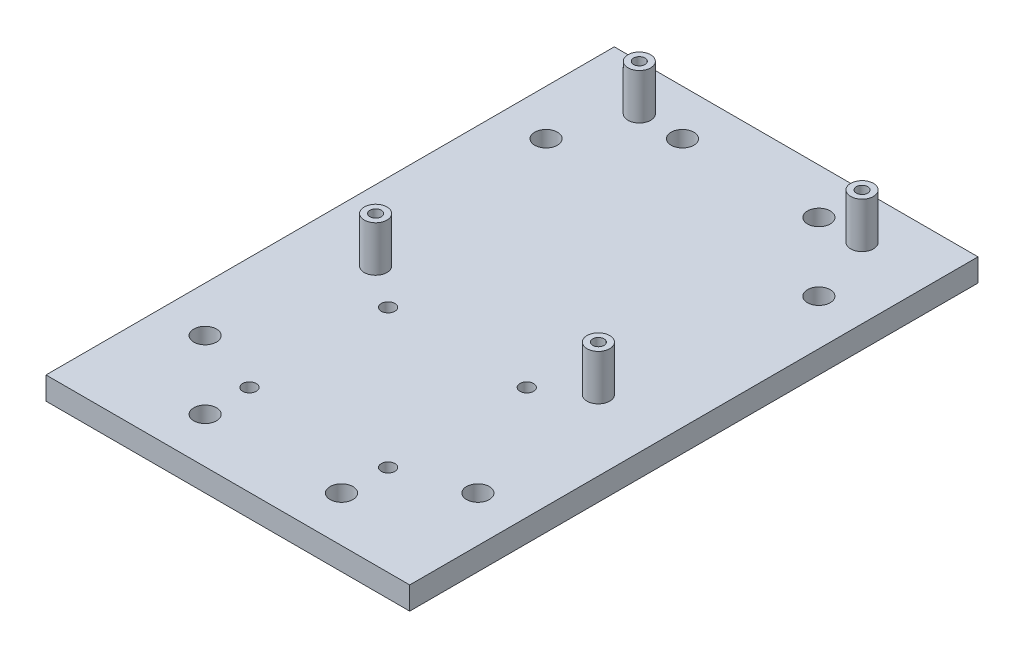
ISO-10303-21;
HEADER;
FILE_DESCRIPTION(('STEP AP214'),'2;1');
FILE_NAME('part.step','',(''),(''),'','','');
FILE_SCHEMA(('AUTOMOTIVE_DESIGN { 1 0 10303 214 1 1 1 1 }'));
ENDSEC;
DATA;
#1=APPLICATION_CONTEXT('core data for automotive mechanical design processes');
#2=APPLICATION_PROTOCOL_DEFINITION('international standard','automotive_design',2000,#1);
#3=PRODUCT_CONTEXT('',#1,'mechanical');
#4=PRODUCT('Part','Part','',(#3));
#5=PRODUCT_RELATED_PRODUCT_CATEGORY('part','',(#4));
#6=PRODUCT_DEFINITION_FORMATION('','',#4);
#7=PRODUCT_DEFINITION_CONTEXT('part definition',#1,'design');
#8=PRODUCT_DEFINITION('design','',#6,#7);
#9=PRODUCT_DEFINITION_SHAPE('','',#8);
#10=(LENGTH_UNIT() NAMED_UNIT(*) SI_UNIT(.MILLI.,.METRE.));
#11=(NAMED_UNIT(*) PLANE_ANGLE_UNIT() SI_UNIT($,.RADIAN.));
#12=(NAMED_UNIT(*) SI_UNIT($,.STERADIAN.) SOLID_ANGLE_UNIT());
#13=UNCERTAINTY_MEASURE_WITH_UNIT(LENGTH_MEASURE(1.E-05),#10,'distance_accuracy_value','');
#14=(GEOMETRIC_REPRESENTATION_CONTEXT(3) GLOBAL_UNCERTAINTY_ASSIGNED_CONTEXT((#13)) GLOBAL_UNIT_ASSIGNED_CONTEXT((#10,
#11,#12)) REPRESENTATION_CONTEXT('',''));
#15=CARTESIAN_POINT('',(0.,0.,0.));
#16=DIRECTION('',(0.,0.,1.));
#17=DIRECTION('',(1.,0.,0.));
#18=AXIS2_PLACEMENT_3D('',#15,#16,#17);
#19=CARTESIAN_POINT('',(0.,5.,0.));
#20=DIRECTION('',(0.,-1.,0.));
#21=DIRECTION('',(0.,0.,-1.));
#22=AXIS2_PLACEMENT_3D('',#19,#20,#21);
#23=PLANE('',#22);
#24=CARTESIAN_POINT('',(-24.5,5.,5.5));
#25=DIRECTION('',(0.,-1.,0.));
#26=DIRECTION('',(0.,0.,-1.));
#27=AXIS2_PLACEMENT_3D('',#24,#25,#26);
#28=CIRCLE('',#27,2.5);
#29=CARTESIAN_POINT('',(-24.5,5.,3.));
#30=VERTEX_POINT('',#29);
#31=EDGE_CURVE('E44',#30,#30,#28,.F.);
#32=ORIENTED_EDGE('',*,*,#31,.F.);
#33=EDGE_LOOP('',(#32));
#34=FACE_BOUND('',#33,.T.);
#35=CARTESIAN_POINT('',(-24.5,5.,-52.5));
#36=DIRECTION('',(0.,-1.,0.));
#37=DIRECTION('',(0.,0.,-1.));
#38=AXIS2_PLACEMENT_3D('',#35,#36,#37);
#39=CIRCLE('',#38,2.5);
#40=CARTESIAN_POINT('',(-24.5,5.,-55.));
#41=VERTEX_POINT('',#40);
#42=EDGE_CURVE('E113',#41,#41,#39,.F.);
#43=ORIENTED_EDGE('',*,*,#42,.F.);
#44=EDGE_LOOP('',(#43));
#45=FACE_BOUND('',#44,.T.);
#46=CARTESIAN_POINT('',(-29.9999999999999,5.,-37.5));
#47=DIRECTION('',(0.,1.,0.));
#48=DIRECTION('',(0.,0.,1.));
#49=AXIS2_PLACEMENT_3D('',#46,#47,#48);
#50=CIRCLE('',#49,2.5);
#51=CARTESIAN_POINT('',(-29.9999999999999,5.,-35.));
#52=VERTEX_POINT('',#51);
#53=EDGE_CURVE('E132',#52,#52,#50,.T.);
#54=ORIENTED_EDGE('',*,*,#53,.F.);
#55=EDGE_LOOP('',(#54));
#56=FACE_BOUND('',#55,.T.);
#57=CARTESIAN_POINT('',(14.9999999999996,5.,-52.5));
#58=DIRECTION('',(0.,1.,0.));
#59=DIRECTION('',(0.,0.,-1.));
#60=AXIS2_PLACEMENT_3D('',#57,#58,#59);
#61=CIRCLE('',#60,2.50000000000001);
#62=CARTESIAN_POINT('',(14.9999999999996,5.,-55.));
#63=VERTEX_POINT('',#62);
#64=EDGE_CURVE('E136',#63,#63,#61,.T.);
#65=ORIENTED_EDGE('',*,*,#64,.F.);
#66=EDGE_LOOP('',(#65));
#67=FACE_BOUND('',#66,.T.);
#68=CARTESIAN_POINT('',(29.9999999999996,5.,-37.5));
#69=DIRECTION('',(0.,1.,0.));
#70=DIRECTION('',(0.,0.,-1.));
#71=AXIS2_PLACEMENT_3D('',#68,#69,#70);
#72=CIRCLE('',#71,2.50000000000001);
#73=CARTESIAN_POINT('',(29.9999999999996,5.,-40.));
#74=VERTEX_POINT('',#73);
#75=EDGE_CURVE('E140',#74,#74,#72,.T.);
#76=ORIENTED_EDGE('',*,*,#75,.F.);
#77=EDGE_LOOP('',(#76));
#78=FACE_BOUND('',#77,.T.);
#79=CARTESIAN_POINT('',(29.9999999999996,5.,37.5));
#80=DIRECTION('',(0.,1.,0.));
#81=DIRECTION('',(0.,0.,1.));
#82=AXIS2_PLACEMENT_3D('',#79,#80,#81);
#83=CIRCLE('',#82,2.50000000000001);
#84=CARTESIAN_POINT('',(29.9999999999996,5.,40.));
#85=VERTEX_POINT('',#84);
#86=EDGE_CURVE('E144',#85,#85,#83,.T.);
#87=ORIENTED_EDGE('',*,*,#86,.F.);
#88=EDGE_LOOP('',(#87));
#89=FACE_BOUND('',#88,.T.);
#90=CARTESIAN_POINT('',(14.9999999999996,5.,52.5));
#91=DIRECTION('',(0.,1.,0.));
#92=DIRECTION('',(0.,0.,1.));
#93=AXIS2_PLACEMENT_3D('',#90,#91,#92);
#94=CIRCLE('',#93,2.50000000000001);
#95=CARTESIAN_POINT('',(14.9999999999996,5.,55.));
#96=VERTEX_POINT('',#95);
#97=EDGE_CURVE('E148',#96,#96,#94,.T.);
#98=ORIENTED_EDGE('',*,*,#97,.F.);
#99=EDGE_LOOP('',(#98));
#100=FACE_BOUND('',#99,.T.);
#101=CARTESIAN_POINT('',(-15.,5.,52.5));
#102=DIRECTION('',(0.,1.,0.));
#103=DIRECTION('',(0.,0.,-1.));
#104=AXIS2_PLACEMENT_3D('',#101,#102,#103);
#105=CIRCLE('',#104,2.5);
#106=CARTESIAN_POINT('',(-15.,5.,50.));
#107=VERTEX_POINT('',#106);
#108=EDGE_CURVE('E152',#107,#107,#105,.T.);
#109=ORIENTED_EDGE('',*,*,#108,.F.);
#110=EDGE_LOOP('',(#109));
#111=FACE_BOUND('',#110,.T.);
#112=CARTESIAN_POINT('',(-29.9999999999999,5.,37.5));
#113=DIRECTION('',(0.,1.,0.));
#114=DIRECTION('',(0.,0.,-1.));
#115=AXIS2_PLACEMENT_3D('',#112,#113,#114);
#116=CIRCLE('',#115,2.5);
#117=CARTESIAN_POINT('',(-29.9999999999999,5.,35.));
#118=VERTEX_POINT('',#117);
#119=EDGE_CURVE('E156',#118,#118,#116,.T.);
#120=ORIENTED_EDGE('',*,*,#119,.F.);
#121=EDGE_LOOP('',(#120));
#122=FACE_BOUND('',#121,.T.);
#123=CARTESIAN_POINT('',(-15.,5.,-52.5));
#124=DIRECTION('',(0.,1.,0.));
#125=DIRECTION('',(0.,0.,1.));
#126=AXIS2_PLACEMENT_3D('',#123,#124,#125);
#127=CIRCLE('',#126,2.5);
#128=CARTESIAN_POINT('',(-15.,5.,-50.));
#129=VERTEX_POINT('',#128);
#130=EDGE_CURVE('E159',#129,#129,#127,.T.);
#131=ORIENTED_EDGE('',*,*,#130,.F.);
#132=EDGE_LOOP('',(#131));
#133=FACE_BOUND('',#132,.T.);
#134=DIRECTION('',(0.,0.,-1.));
#135=VECTOR('',#134,1.);
#136=CARTESIAN_POINT('',(40.,5.,62.5));
#137=LINE('',#136,#135);
#138=CARTESIAN_POINT('',(40.,5.,62.5));
#139=VERTEX_POINT('',#138);
#140=CARTESIAN_POINT('',(40.,5.,-62.5));
#141=VERTEX_POINT('',#140);
#142=EDGE_CURVE('E88',#139,#141,#137,.T.);
#143=ORIENTED_EDGE('',*,*,#142,.T.);
#144=DIRECTION('',(-1.,0.,0.));
#145=VECTOR('',#144,1.);
#146=CARTESIAN_POINT('',(-40.,5.,-62.5));
#147=LINE('',#146,#145);
#148=CARTESIAN_POINT('',(-40.,5.,-62.5));
#149=VERTEX_POINT('',#148);
#150=EDGE_CURVE('E83',#141,#149,#147,.T.);
#151=ORIENTED_EDGE('',*,*,#150,.T.);
#152=DIRECTION('',(0.,0.,1.));
#153=VECTOR('',#152,1.);
#154=CARTESIAN_POINT('',(-40.,5.,62.5));
#155=LINE('',#154,#153);
#156=CARTESIAN_POINT('',(-40.,5.,62.5));
#157=VERTEX_POINT('',#156);
#158=EDGE_CURVE('E86',#149,#157,#155,.T.);
#159=ORIENTED_EDGE('',*,*,#158,.T.);
#160=DIRECTION('',(1.,0.,0.));
#161=VECTOR('',#160,1.);
#162=CARTESIAN_POINT('',(-40.,5.,62.5));
#163=LINE('',#162,#161);
#164=EDGE_CURVE('E52',#157,#139,#163,.T.);
#165=ORIENTED_EDGE('',*,*,#164,.T.);
#166=EDGE_LOOP('',(#143,#151,#159,#165));
#167=FACE_BOUND('',#166,.T.);
#168=CARTESIAN_POINT('',(-15.2500000000035,5.,12.));
#169=DIRECTION('',(0.,1.,0.));
#170=DIRECTION('',(0.,0.,1.));
#171=AXIS2_PLACEMENT_3D('',#168,#169,#170);
#172=CIRCLE('',#171,1.5);
#173=CARTESIAN_POINT('',(-15.2500000000035,5.,13.5));
#174=VERTEX_POINT('',#173);
#175=EDGE_CURVE('E189',#174,#174,#172,.T.);
#176=ORIENTED_EDGE('',*,*,#175,.F.);
#177=EDGE_LOOP('',(#176));
#178=FACE_BOUND('',#177,.T.);
#179=CARTESIAN_POINT('',(15.2500000000035,5.,12.));
#180=DIRECTION('',(0.,1.,0.));
#181=DIRECTION('',(0.,0.,1.));
#182=AXIS2_PLACEMENT_3D('',#179,#180,#181);
#183=CIRCLE('',#182,1.5);
#184=CARTESIAN_POINT('',(15.2500000000035,5.,13.5));
#185=VERTEX_POINT('',#184);
#186=EDGE_CURVE('E183',#185,#185,#183,.T.);
#187=ORIENTED_EDGE('',*,*,#186,.F.);
#188=EDGE_LOOP('',(#187));
#189=FACE_BOUND('',#188,.T.);
#190=CARTESIAN_POINT('',(-15.25,5.,42.5));
#191=DIRECTION('',(0.,1.,0.));
#192=DIRECTION('',(0.,0.,1.));
#193=AXIS2_PLACEMENT_3D('',#190,#191,#192);
#194=CIRCLE('',#193,1.5);
#195=CARTESIAN_POINT('',(-15.25,5.,44.));
#196=VERTEX_POINT('',#195);
#197=EDGE_CURVE('E177',#196,#196,#194,.T.);
#198=ORIENTED_EDGE('',*,*,#197,.F.);
#199=EDGE_LOOP('',(#198));
#200=FACE_BOUND('',#199,.T.);
#201=CARTESIAN_POINT('',(15.250000000007,5.,42.5));
#202=DIRECTION('',(0.,1.,0.));
#203=DIRECTION('',(0.,0.,1.));
#204=AXIS2_PLACEMENT_3D('',#201,#202,#203);
#205=CIRCLE('',#204,1.5);
#206=CARTESIAN_POINT('',(15.250000000007,5.,44.));
#207=VERTEX_POINT('',#206);
#208=EDGE_CURVE('E171',#207,#207,#205,.T.);
#209=ORIENTED_EDGE('',*,*,#208,.F.);
#210=EDGE_LOOP('',(#209));
#211=FACE_BOUND('',#210,.T.);
#212=CARTESIAN_POINT('',(24.5,5.,-52.5));
#213=DIRECTION('',(0.,-1.,0.));
#214=DIRECTION('',(0.,0.,-1.));
#215=AXIS2_PLACEMENT_3D('',#212,#213,#214);
#216=CIRCLE('',#215,2.5);
#217=CARTESIAN_POINT('',(24.5,5.,-55.));
#218=VERTEX_POINT('',#217);
#219=EDGE_CURVE('E116',#218,#218,#216,.F.);
#220=ORIENTED_EDGE('',*,*,#219,.F.);
#221=EDGE_LOOP('',(#220));
#222=FACE_BOUND('',#221,.T.);
#223=CARTESIAN_POINT('',(24.5000000000002,5.,5.5));
#224=DIRECTION('',(0.,-1.,0.));
#225=DIRECTION('',(0.,0.,-1.));
#226=AXIS2_PLACEMENT_3D('',#223,#224,#225);
#227=CIRCLE('',#226,2.5);
#228=CARTESIAN_POINT('',(24.5000000000002,5.,3.));
#229=VERTEX_POINT('',#228);
#230=EDGE_CURVE('E11',#229,#229,#227,.F.);
#231=ORIENTED_EDGE('',*,*,#230,.F.);
#232=EDGE_LOOP('',(#231));
#233=FACE_BOUND('',#232,.T.);
#234=ADVANCED_FACE('F35',(#34,#45,#56,#67,#78,#89,#100,#111,#122,#133,#167,#178,#189,#200,#211,
#222,#233),#23,.F.);
#235=CARTESIAN_POINT('',(0.,0.,0.));
#236=DIRECTION('',(0.,-1.,0.));
#237=DIRECTION('',(0.,0.,-1.));
#238=AXIS2_PLACEMENT_3D('',#235,#236,#237);
#239=PLANE('',#238);
#240=CARTESIAN_POINT('',(-29.9999999999999,0.,-37.5));
#241=DIRECTION('',(0.,1.,0.));
#242=DIRECTION('',(0.,0.,1.));
#243=AXIS2_PLACEMENT_3D('',#240,#241,#242);
#244=CIRCLE('',#243,2.5);
#245=CARTESIAN_POINT('',(-29.9999999999999,0.,-35.));
#246=VERTEX_POINT('',#245);
#247=EDGE_CURVE('E162',#246,#246,#244,.T.);
#248=ORIENTED_EDGE('',*,*,#247,.T.);
#249=EDGE_LOOP('',(#248));
#250=FACE_BOUND('',#249,.T.);
#251=CARTESIAN_POINT('',(14.9999999999996,0.,-52.5));
#252=DIRECTION('',(0.,1.,0.));
#253=DIRECTION('',(0.,0.,-1.));
#254=AXIS2_PLACEMENT_3D('',#251,#252,#253);
#255=CIRCLE('',#254,2.50000000000001);
#256=CARTESIAN_POINT('',(14.9999999999996,0.,-55.));
#257=VERTEX_POINT('',#256);
#258=EDGE_CURVE('E241',#257,#257,#255,.T.);
#259=ORIENTED_EDGE('',*,*,#258,.T.);
#260=EDGE_LOOP('',(#259));
#261=FACE_BOUND('',#260,.T.);
#262=CARTESIAN_POINT('',(29.9999999999996,0.,-37.5));
#263=DIRECTION('',(0.,1.,0.));
#264=DIRECTION('',(0.,0.,-1.));
#265=AXIS2_PLACEMENT_3D('',#262,#263,#264);
#266=CIRCLE('',#265,2.50000000000001);
#267=CARTESIAN_POINT('',(29.9999999999996,0.,-40.));
#268=VERTEX_POINT('',#267);
#269=EDGE_CURVE('E245',#268,#268,#266,.T.);
#270=ORIENTED_EDGE('',*,*,#269,.T.);
#271=EDGE_LOOP('',(#270));
#272=FACE_BOUND('',#271,.T.);
#273=CARTESIAN_POINT('',(29.9999999999996,0.,37.5));
#274=DIRECTION('',(0.,1.,0.));
#275=DIRECTION('',(0.,0.,1.));
#276=AXIS2_PLACEMENT_3D('',#273,#274,#275);
#277=CIRCLE('',#276,2.50000000000001);
#278=CARTESIAN_POINT('',(29.9999999999996,0.,40.));
#279=VERTEX_POINT('',#278);
#280=EDGE_CURVE('E249',#279,#279,#277,.T.);
#281=ORIENTED_EDGE('',*,*,#280,.T.);
#282=EDGE_LOOP('',(#281));
#283=FACE_BOUND('',#282,.T.);
#284=CARTESIAN_POINT('',(14.9999999999996,0.,52.5));
#285=DIRECTION('',(0.,1.,0.));
#286=DIRECTION('',(0.,0.,1.));
#287=AXIS2_PLACEMENT_3D('',#284,#285,#286);
#288=CIRCLE('',#287,2.50000000000001);
#289=CARTESIAN_POINT('',(14.9999999999996,0.,55.));
#290=VERTEX_POINT('',#289);
#291=EDGE_CURVE('E228',#290,#290,#288,.T.);
#292=ORIENTED_EDGE('',*,*,#291,.T.);
#293=EDGE_LOOP('',(#292));
#294=FACE_BOUND('',#293,.T.);
#295=CARTESIAN_POINT('',(-15.,0.,52.5));
#296=DIRECTION('',(0.,1.,0.));
#297=DIRECTION('',(0.,0.,-1.));
#298=AXIS2_PLACEMENT_3D('',#295,#296,#297);
#299=CIRCLE('',#298,2.5);
#300=CARTESIAN_POINT('',(-15.,0.,50.));
#301=VERTEX_POINT('',#300);
#302=EDGE_CURVE('E232',#301,#301,#299,.T.);
#303=ORIENTED_EDGE('',*,*,#302,.T.);
#304=EDGE_LOOP('',(#303));
#305=FACE_BOUND('',#304,.T.);
#306=CARTESIAN_POINT('',(-29.9999999999999,0.,37.5));
#307=DIRECTION('',(0.,1.,0.));
#308=DIRECTION('',(0.,0.,-1.));
#309=AXIS2_PLACEMENT_3D('',#306,#307,#308);
#310=CIRCLE('',#309,2.5);
#311=CARTESIAN_POINT('',(-29.9999999999999,0.,35.));
#312=VERTEX_POINT('',#311);
#313=EDGE_CURVE('E236',#312,#312,#310,.T.);
#314=ORIENTED_EDGE('',*,*,#313,.T.);
#315=EDGE_LOOP('',(#314));
#316=FACE_BOUND('',#315,.T.);
#317=CARTESIAN_POINT('',(-15.,0.,-52.5));
#318=DIRECTION('',(0.,1.,0.));
#319=DIRECTION('',(0.,0.,1.));
#320=AXIS2_PLACEMENT_3D('',#317,#318,#319);
#321=CIRCLE('',#320,2.5);
#322=CARTESIAN_POINT('',(-15.,0.,-50.));
#323=VERTEX_POINT('',#322);
#324=EDGE_CURVE('E161',#323,#323,#321,.T.);
#325=ORIENTED_EDGE('',*,*,#324,.T.);
#326=EDGE_LOOP('',(#325));
#327=FACE_BOUND('',#326,.T.);
#328=CARTESIAN_POINT('',(-15.25,0.,42.5));
#329=DIRECTION('',(0.,1.,0.));
#330=DIRECTION('',(0.,0.,1.));
#331=AXIS2_PLACEMENT_3D('',#328,#329,#330);
#332=CIRCLE('',#331,1.5);
#333=CARTESIAN_POINT('',(-15.25,0.,44.));
#334=VERTEX_POINT('',#333);
#335=EDGE_CURVE('E174',#334,#334,#332,.T.);
#336=ORIENTED_EDGE('',*,*,#335,.T.);
#337=EDGE_LOOP('',(#336));
#338=FACE_BOUND('',#337,.T.);
#339=CARTESIAN_POINT('',(-15.2500000000035,0.,12.));
#340=DIRECTION('',(0.,1.,0.));
#341=DIRECTION('',(0.,0.,1.));
#342=AXIS2_PLACEMENT_3D('',#339,#340,#341);
#343=CIRCLE('',#342,1.5);
#344=CARTESIAN_POINT('',(-15.2500000000035,0.,13.5));
#345=VERTEX_POINT('',#344);
#346=EDGE_CURVE('E186',#345,#345,#343,.T.);
#347=ORIENTED_EDGE('',*,*,#346,.T.);
#348=EDGE_LOOP('',(#347));
#349=FACE_BOUND('',#348,.T.);
#350=CARTESIAN_POINT('',(-24.5,0.,5.5));
#351=DIRECTION('',(0.,1.,0.));
#352=DIRECTION('',(0.,0.,1.));
#353=AXIS2_PLACEMENT_3D('',#350,#351,#352);
#354=CIRCLE('',#353,1.25);
#355=CARTESIAN_POINT('',(-24.5,0.,6.75));
#356=VERTEX_POINT('',#355);
#357=EDGE_CURVE('E197',#356,#356,#354,.T.);
#358=ORIENTED_EDGE('',*,*,#357,.T.);
#359=EDGE_LOOP('',(#358));
#360=FACE_BOUND('',#359,.T.);
#361=CARTESIAN_POINT('',(-24.5,0.,-52.5));
#362=DIRECTION('',(0.,1.,0.));
#363=DIRECTION('',(0.,0.,1.));
#364=AXIS2_PLACEMENT_3D('',#361,#362,#363);
#365=CIRCLE('',#364,1.25);
#366=CARTESIAN_POINT('',(-24.5,0.,-51.25));
#367=VERTEX_POINT('',#366);
#368=EDGE_CURVE('E106',#367,#367,#365,.T.);
#369=ORIENTED_EDGE('',*,*,#368,.T.);
#370=EDGE_LOOP('',(#369));
#371=FACE_BOUND('',#370,.T.);
#372=DIRECTION('',(0.,0.,-1.));
#373=VECTOR('',#372,1.);
#374=CARTESIAN_POINT('',(40.,0.,62.5));
#375=LINE('',#374,#373);
#376=CARTESIAN_POINT('',(40.,0.,62.5));
#377=VERTEX_POINT('',#376);
#378=CARTESIAN_POINT('',(40.,0.,-62.5));
#379=VERTEX_POINT('',#378);
#380=EDGE_CURVE('E103',#377,#379,#375,.T.);
#381=ORIENTED_EDGE('',*,*,#380,.F.);
#382=DIRECTION('',(1.,0.,0.));
#383=VECTOR('',#382,1.);
#384=CARTESIAN_POINT('',(-40.,0.,62.5));
#385=LINE('',#384,#383);
#386=CARTESIAN_POINT('',(-40.,0.,62.5));
#387=VERTEX_POINT('',#386);
#388=EDGE_CURVE('E75',#387,#377,#385,.T.);
#389=ORIENTED_EDGE('',*,*,#388,.F.);
#390=DIRECTION('',(0.,0.,1.));
#391=VECTOR('',#390,1.);
#392=CARTESIAN_POINT('',(-40.,0.,62.5));
#393=LINE('',#392,#391);
#394=CARTESIAN_POINT('',(-40.,0.,-62.5));
#395=VERTEX_POINT('',#394);
#396=EDGE_CURVE('E69',#395,#387,#393,.T.);
#397=ORIENTED_EDGE('',*,*,#396,.F.);
#398=DIRECTION('',(-1.,0.,0.));
#399=VECTOR('',#398,1.);
#400=CARTESIAN_POINT('',(-40.,0.,-62.5));
#401=LINE('',#400,#399);
#402=EDGE_CURVE('E93',#379,#395,#401,.T.);
#403=ORIENTED_EDGE('',*,*,#402,.F.);
#404=EDGE_LOOP('',(#381,#389,#397,#403));
#405=FACE_BOUND('',#404,.T.);
#406=CARTESIAN_POINT('',(24.5,0.,-52.5));
#407=DIRECTION('',(0.,1.,0.));
#408=DIRECTION('',(0.,0.,1.));
#409=AXIS2_PLACEMENT_3D('',#406,#407,#408);
#410=CIRCLE('',#409,1.25);
#411=CARTESIAN_POINT('',(24.5,0.,-51.25));
#412=VERTEX_POINT('',#411);
#413=EDGE_CURVE('E200',#412,#412,#410,.T.);
#414=ORIENTED_EDGE('',*,*,#413,.T.);
#415=EDGE_LOOP('',(#414));
#416=FACE_BOUND('',#415,.T.);
#417=CARTESIAN_POINT('',(24.5000000000002,0.,5.5));
#418=DIRECTION('',(0.,1.,0.));
#419=DIRECTION('',(0.,0.,1.));
#420=AXIS2_PLACEMENT_3D('',#417,#418,#419);
#421=CIRCLE('',#420,1.25);
#422=CARTESIAN_POINT('',(24.5000000000002,0.,6.75));
#423=VERTEX_POINT('',#422);
#424=EDGE_CURVE('E192',#423,#423,#421,.T.);
#425=ORIENTED_EDGE('',*,*,#424,.T.);
#426=EDGE_LOOP('',(#425));
#427=FACE_BOUND('',#426,.T.);
#428=CARTESIAN_POINT('',(15.2500000000035,0.,12.));
#429=DIRECTION('',(0.,1.,0.));
#430=DIRECTION('',(0.,0.,1.));
#431=AXIS2_PLACEMENT_3D('',#428,#429,#430);
#432=CIRCLE('',#431,1.5);
#433=CARTESIAN_POINT('',(15.2500000000035,0.,13.5));
#434=VERTEX_POINT('',#433);
#435=EDGE_CURVE('E180',#434,#434,#432,.T.);
#436=ORIENTED_EDGE('',*,*,#435,.T.);
#437=EDGE_LOOP('',(#436));
#438=FACE_BOUND('',#437,.T.);
#439=CARTESIAN_POINT('',(15.250000000007,0.,42.5));
#440=DIRECTION('',(0.,1.,0.));
#441=DIRECTION('',(0.,0.,1.));
#442=AXIS2_PLACEMENT_3D('',#439,#440,#441);
#443=CIRCLE('',#442,1.5);
#444=CARTESIAN_POINT('',(15.250000000007,0.,44.));
#445=VERTEX_POINT('',#444);
#446=EDGE_CURVE('E165',#445,#445,#443,.T.);
#447=ORIENTED_EDGE('',*,*,#446,.T.);
#448=EDGE_LOOP('',(#447));
#449=FACE_BOUND('',#448,.T.);
#450=ADVANCED_FACE('F125',(#250,#261,#272,#283,#294,#305,#316,#327,#338,#349,#360,#371,#405,
#416,#427,#438,#449),#239,.T.);
#451=CARTESIAN_POINT('',(40.,5.,62.5));
#452=DIRECTION('',(-1.,0.,0.));
#453=DIRECTION('',(0.,0.,1.));
#454=AXIS2_PLACEMENT_3D('',#451,#452,#453);
#455=PLANE('',#454);
#456=ORIENTED_EDGE('',*,*,#380,.T.);
#457=DIRECTION('',(0.,-1.,0.));
#458=VECTOR('',#457,1.);
#459=CARTESIAN_POINT('',(40.,5.,-62.5));
#460=LINE('',#459,#458);
#461=EDGE_CURVE('E94',#141,#379,#460,.T.);
#462=ORIENTED_EDGE('',*,*,#461,.F.);
#463=ORIENTED_EDGE('',*,*,#142,.F.);
#464=DIRECTION('',(0.,-1.,0.));
#465=VECTOR('',#464,1.);
#466=CARTESIAN_POINT('',(40.,5.,62.5));
#467=LINE('',#466,#465);
#468=EDGE_CURVE('E99',#139,#377,#467,.T.);
#469=ORIENTED_EDGE('',*,*,#468,.T.);
#470=EDGE_LOOP('',(#456,#462,#463,#469));
#471=FACE_BOUND('',#470,.T.);
#472=ADVANCED_FACE('F37',(#471),#455,.F.);
#473=CARTESIAN_POINT('',(-40.,5.,-62.5));
#474=DIRECTION('',(0.,0.,1.));
#475=DIRECTION('',(1.,0.,0.));
#476=AXIS2_PLACEMENT_3D('',#473,#474,#475);
#477=PLANE('',#476);
#478=ORIENTED_EDGE('',*,*,#402,.T.);
#479=DIRECTION('',(0.,-1.,0.));
#480=VECTOR('',#479,1.);
#481=CARTESIAN_POINT('',(-40.,5.,-62.5));
#482=LINE('',#481,#480);
#483=EDGE_CURVE('E91',#149,#395,#482,.T.);
#484=ORIENTED_EDGE('',*,*,#483,.F.);
#485=ORIENTED_EDGE('',*,*,#150,.F.);
#486=ORIENTED_EDGE('',*,*,#461,.T.);
#487=EDGE_LOOP('',(#478,#484,#485,#486));
#488=FACE_BOUND('',#487,.T.);
#489=ADVANCED_FACE('F92',(#488),#477,.F.);
#490=CARTESIAN_POINT('',(-40.,5.,62.5));
#491=DIRECTION('',(1.,0.,0.));
#492=DIRECTION('',(0.,0.,-1.));
#493=AXIS2_PLACEMENT_3D('',#490,#491,#492);
#494=PLANE('',#493);
#495=ORIENTED_EDGE('',*,*,#396,.T.);
#496=DIRECTION('',(0.,-1.,0.));
#497=VECTOR('',#496,1.);
#498=CARTESIAN_POINT('',(-40.,5.,62.5));
#499=LINE('',#498,#497);
#500=EDGE_CURVE('E95',#157,#387,#499,.T.);
#501=ORIENTED_EDGE('',*,*,#500,.F.);
#502=ORIENTED_EDGE('',*,*,#158,.F.);
#503=ORIENTED_EDGE('',*,*,#483,.T.);
#504=EDGE_LOOP('',(#495,#501,#502,#503));
#505=FACE_BOUND('',#504,.T.);
#506=ADVANCED_FACE('F97',(#505),#494,.F.);
#507=CARTESIAN_POINT('',(-40.,5.,62.5));
#508=DIRECTION('',(0.,0.,-1.));
#509=DIRECTION('',(-1.,0.,0.));
#510=AXIS2_PLACEMENT_3D('',#507,#508,#509);
#511=PLANE('',#510);
#512=ORIENTED_EDGE('',*,*,#388,.T.);
#513=ORIENTED_EDGE('',*,*,#468,.F.);
#514=ORIENTED_EDGE('',*,*,#164,.F.);
#515=ORIENTED_EDGE('',*,*,#500,.T.);
#516=EDGE_LOOP('',(#512,#513,#514,#515));
#517=FACE_BOUND('',#516,.T.);
#518=ADVANCED_FACE('F212',(#517),#511,.F.);
#519=CARTESIAN_POINT('',(-24.5,5.,-52.5));
#520=DIRECTION('',(0.,-1.,0.));
#521=DIRECTION('',(0.,0.,-1.));
#522=AXIS2_PLACEMENT_3D('',#519,#520,#521);
#523=CYLINDRICAL_SURFACE('',#522,1.25);
#524=ORIENTED_EDGE('',*,*,#368,.F.);
#525=EDGE_LOOP('',(#524));
#526=FACE_BOUND('',#525,.T.);
#527=CARTESIAN_POINT('',(-24.5,15.,-52.5));
#528=DIRECTION('',(0.,1.,0.));
#529=DIRECTION('',(0.,0.,1.));
#530=AXIS2_PLACEMENT_3D('',#527,#528,#529);
#531=CIRCLE('',#530,1.25);
#532=CARTESIAN_POINT('',(-24.5,15.,-51.25));
#533=VERTEX_POINT('',#532);
#534=EDGE_CURVE('E216',#533,#533,#531,.T.);
#535=ORIENTED_EDGE('',*,*,#534,.T.);
#536=EDGE_LOOP('',(#535));
#537=FACE_BOUND('',#536,.T.);
#538=ADVANCED_FACE('F208',(#526,#537),#523,.F.);
#539=CARTESIAN_POINT('',(24.5,5.,-52.5));
#540=DIRECTION('',(0.,-1.,0.));
#541=DIRECTION('',(0.,0.,-1.));
#542=AXIS2_PLACEMENT_3D('',#539,#540,#541);
#543=CYLINDRICAL_SURFACE('',#542,1.25);
#544=ORIENTED_EDGE('',*,*,#413,.F.);
#545=EDGE_LOOP('',(#544));
#546=FACE_BOUND('',#545,.T.);
#547=CARTESIAN_POINT('',(24.5,15.,-52.5));
#548=DIRECTION('',(0.,1.,0.));
#549=DIRECTION('',(0.,0.,1.));
#550=AXIS2_PLACEMENT_3D('',#547,#548,#549);
#551=CIRCLE('',#550,1.25);
#552=CARTESIAN_POINT('',(24.5,15.,-51.25));
#553=VERTEX_POINT('',#552);
#554=EDGE_CURVE('E224',#553,#553,#551,.T.);
#555=ORIENTED_EDGE('',*,*,#554,.T.);
#556=EDGE_LOOP('',(#555));
#557=FACE_BOUND('',#556,.T.);
#558=ADVANCED_FACE('F211',(#546,#557),#543,.F.);
#559=CARTESIAN_POINT('',(-24.5,5.,5.5));
#560=DIRECTION('',(0.,-1.,0.));
#561=DIRECTION('',(0.,0.,-1.));
#562=AXIS2_PLACEMENT_3D('',#559,#560,#561);
#563=CYLINDRICAL_SURFACE('',#562,1.25);
#564=ORIENTED_EDGE('',*,*,#357,.F.);
#565=EDGE_LOOP('',(#564));
#566=FACE_BOUND('',#565,.T.);
#567=CARTESIAN_POINT('',(-24.5,15.,5.5));
#568=DIRECTION('',(0.,1.,0.));
#569=DIRECTION('',(0.,0.,1.));
#570=AXIS2_PLACEMENT_3D('',#567,#568,#569);
#571=CIRCLE('',#570,1.25);
#572=CARTESIAN_POINT('',(-24.5,15.,6.75));
#573=VERTEX_POINT('',#572);
#574=EDGE_CURVE('E335',#573,#573,#571,.T.);
#575=ORIENTED_EDGE('',*,*,#574,.T.);
#576=EDGE_LOOP('',(#575));
#577=FACE_BOUND('',#576,.T.);
#578=ADVANCED_FACE('F295',(#566,#577),#563,.F.);
#579=CARTESIAN_POINT('',(24.5000000000002,5.,5.5));
#580=DIRECTION('',(0.,-1.,0.));
#581=DIRECTION('',(0.,0.,-1.));
#582=AXIS2_PLACEMENT_3D('',#579,#580,#581);
#583=CYLINDRICAL_SURFACE('',#582,1.25);
#584=ORIENTED_EDGE('',*,*,#424,.F.);
#585=EDGE_LOOP('',(#584));
#586=FACE_BOUND('',#585,.T.);
#587=CARTESIAN_POINT('',(24.5000000000002,15.,5.5));
#588=DIRECTION('',(0.,1.,0.));
#589=DIRECTION('',(0.,0.,1.));
#590=AXIS2_PLACEMENT_3D('',#587,#588,#589);
#591=CIRCLE('',#590,1.25);
#592=CARTESIAN_POINT('',(24.5000000000002,15.,6.75));
#593=VERTEX_POINT('',#592);
#594=EDGE_CURVE('E330',#593,#593,#591,.T.);
#595=ORIENTED_EDGE('',*,*,#594,.T.);
#596=EDGE_LOOP('',(#595));
#597=FACE_BOUND('',#596,.T.);
#598=ADVANCED_FACE('F291',(#586,#597),#583,.F.);
#599=CARTESIAN_POINT('',(-15.2500000000035,5.,12.));
#600=DIRECTION('',(0.,-1.,0.));
#601=DIRECTION('',(0.,0.,-1.));
#602=AXIS2_PLACEMENT_3D('',#599,#600,#601);
#603=CYLINDRICAL_SURFACE('',#602,1.5);
#604=ORIENTED_EDGE('',*,*,#175,.T.);
#605=EDGE_LOOP('',(#604));
#606=FACE_BOUND('',#605,.T.);
#607=ORIENTED_EDGE('',*,*,#346,.F.);
#608=EDGE_LOOP('',(#607));
#609=FACE_BOUND('',#608,.T.);
#610=ADVANCED_FACE('F287',(#606,#609),#603,.F.);
#611=CARTESIAN_POINT('',(15.2500000000035,5.,12.));
#612=DIRECTION('',(0.,-1.,0.));
#613=DIRECTION('',(0.,0.,-1.));
#614=AXIS2_PLACEMENT_3D('',#611,#612,#613);
#615=CYLINDRICAL_SURFACE('',#614,1.5);
#616=ORIENTED_EDGE('',*,*,#186,.T.);
#617=EDGE_LOOP('',(#616));
#618=FACE_BOUND('',#617,.T.);
#619=ORIENTED_EDGE('',*,*,#435,.F.);
#620=EDGE_LOOP('',(#619));
#621=FACE_BOUND('',#620,.T.);
#622=ADVANCED_FACE('F283',(#618,#621),#615,.F.);
#623=CARTESIAN_POINT('',(-15.25,5.,42.5));
#624=DIRECTION('',(0.,-1.,0.));
#625=DIRECTION('',(0.,0.,-1.));
#626=AXIS2_PLACEMENT_3D('',#623,#624,#625);
#627=CYLINDRICAL_SURFACE('',#626,1.5);
#628=ORIENTED_EDGE('',*,*,#197,.T.);
#629=EDGE_LOOP('',(#628));
#630=FACE_BOUND('',#629,.T.);
#631=ORIENTED_EDGE('',*,*,#335,.F.);
#632=EDGE_LOOP('',(#631));
#633=FACE_BOUND('',#632,.T.);
#634=ADVANCED_FACE('F279',(#630,#633),#627,.F.);
#635=CARTESIAN_POINT('',(15.250000000007,5.,42.5));
#636=DIRECTION('',(0.,-1.,0.));
#637=DIRECTION('',(0.,0.,-1.));
#638=AXIS2_PLACEMENT_3D('',#635,#636,#637);
#639=CYLINDRICAL_SURFACE('',#638,1.5);
#640=ORIENTED_EDGE('',*,*,#208,.T.);
#641=EDGE_LOOP('',(#640));
#642=FACE_BOUND('',#641,.T.);
#643=ORIENTED_EDGE('',*,*,#446,.F.);
#644=EDGE_LOOP('',(#643));
#645=FACE_BOUND('',#644,.T.);
#646=ADVANCED_FACE('F275',(#642,#645),#639,.F.);
#647=CARTESIAN_POINT('',(-15.,0.,-52.5));
#648=DIRECTION('',(0.,1.,0.));
#649=DIRECTION('',(0.,0.,1.));
#650=AXIS2_PLACEMENT_3D('',#647,#648,#649);
#651=CYLINDRICAL_SURFACE('',#650,2.5);
#652=ORIENTED_EDGE('',*,*,#324,.F.);
#653=EDGE_LOOP('',(#652));
#654=FACE_BOUND('',#653,.T.);
#655=ORIENTED_EDGE('',*,*,#130,.T.);
#656=EDGE_LOOP('',(#655));
#657=FACE_BOUND('',#656,.T.);
#658=ADVANCED_FACE('F271',(#654,#657),#651,.F.);
#659=CARTESIAN_POINT('',(-29.9999999999999,0.,37.5));
#660=DIRECTION('',(0.,1.,0.));
#661=DIRECTION('',(0.,0.,1.));
#662=AXIS2_PLACEMENT_3D('',#659,#660,#661);
#663=CYLINDRICAL_SURFACE('',#662,2.5);
#664=ORIENTED_EDGE('',*,*,#313,.F.);
#665=EDGE_LOOP('',(#664));
#666=FACE_BOUND('',#665,.T.);
#667=ORIENTED_EDGE('',*,*,#119,.T.);
#668=EDGE_LOOP('',(#667));
#669=FACE_BOUND('',#668,.T.);
#670=ADVANCED_FACE('F274',(#666,#669),#663,.F.);
#671=CARTESIAN_POINT('',(-15.,0.,52.5));
#672=DIRECTION('',(0.,1.,0.));
#673=DIRECTION('',(0.,0.,1.));
#674=AXIS2_PLACEMENT_3D('',#671,#672,#673);
#675=CYLINDRICAL_SURFACE('',#674,2.5);
#676=ORIENTED_EDGE('',*,*,#302,.F.);
#677=EDGE_LOOP('',(#676));
#678=FACE_BOUND('',#677,.T.);
#679=ORIENTED_EDGE('',*,*,#108,.T.);
#680=EDGE_LOOP('',(#679));
#681=FACE_BOUND('',#680,.T.);
#682=ADVANCED_FACE('F265',(#678,#681),#675,.F.);
#683=CARTESIAN_POINT('',(14.9999999999996,0.,52.5));
#684=DIRECTION('',(0.,1.,0.));
#685=DIRECTION('',(0.,0.,1.));
#686=AXIS2_PLACEMENT_3D('',#683,#684,#685);
#687=CYLINDRICAL_SURFACE('',#686,2.50000000000001);
#688=ORIENTED_EDGE('',*,*,#291,.F.);
#689=EDGE_LOOP('',(#688));
#690=FACE_BOUND('',#689,.T.);
#691=ORIENTED_EDGE('',*,*,#97,.T.);
#692=EDGE_LOOP('',(#691));
#693=FACE_BOUND('',#692,.T.);
#694=ADVANCED_FACE('F255',(#690,#693),#687,.F.);
#695=CARTESIAN_POINT('',(29.9999999999996,0.,37.5));
#696=DIRECTION('',(0.,1.,0.));
#697=DIRECTION('',(0.,0.,1.));
#698=AXIS2_PLACEMENT_3D('',#695,#696,#697);
#699=CYLINDRICAL_SURFACE('',#698,2.50000000000001);
#700=ORIENTED_EDGE('',*,*,#280,.F.);
#701=EDGE_LOOP('',(#700));
#702=FACE_BOUND('',#701,.T.);
#703=ORIENTED_EDGE('',*,*,#86,.T.);
#704=EDGE_LOOP('',(#703));
#705=FACE_BOUND('',#704,.T.);
#706=ADVANCED_FACE('F252',(#702,#705),#699,.F.);
#707=CARTESIAN_POINT('',(29.9999999999996,0.,-37.5));
#708=DIRECTION('',(0.,1.,0.));
#709=DIRECTION('',(0.,0.,1.));
#710=AXIS2_PLACEMENT_3D('',#707,#708,#709);
#711=CYLINDRICAL_SURFACE('',#710,2.50000000000001);
#712=ORIENTED_EDGE('',*,*,#269,.F.);
#713=EDGE_LOOP('',(#712));
#714=FACE_BOUND('',#713,.T.);
#715=ORIENTED_EDGE('',*,*,#75,.T.);
#716=EDGE_LOOP('',(#715));
#717=FACE_BOUND('',#716,.T.);
#718=ADVANCED_FACE('F254',(#714,#717),#711,.F.);
#719=CARTESIAN_POINT('',(14.9999999999996,0.,-52.5));
#720=DIRECTION('',(0.,1.,0.));
#721=DIRECTION('',(0.,0.,1.));
#722=AXIS2_PLACEMENT_3D('',#719,#720,#721);
#723=CYLINDRICAL_SURFACE('',#722,2.50000000000001);
#724=ORIENTED_EDGE('',*,*,#258,.F.);
#725=EDGE_LOOP('',(#724));
#726=FACE_BOUND('',#725,.T.);
#727=ORIENTED_EDGE('',*,*,#64,.T.);
#728=EDGE_LOOP('',(#727));
#729=FACE_BOUND('',#728,.T.);
#730=ADVANCED_FACE('F262',(#726,#729),#723,.F.);
#731=CARTESIAN_POINT('',(-29.9999999999999,0.,-37.5));
#732=DIRECTION('',(0.,1.,0.));
#733=DIRECTION('',(0.,0.,1.));
#734=AXIS2_PLACEMENT_3D('',#731,#732,#733);
#735=CYLINDRICAL_SURFACE('',#734,2.5);
#736=ORIENTED_EDGE('',*,*,#247,.F.);
#737=EDGE_LOOP('',(#736));
#738=FACE_BOUND('',#737,.T.);
#739=ORIENTED_EDGE('',*,*,#53,.T.);
#740=EDGE_LOOP('',(#739));
#741=FACE_BOUND('',#740,.T.);
#742=ADVANCED_FACE('F366',(#738,#741),#735,.F.);
#743=CARTESIAN_POINT('',(-24.5,15.,-52.5));
#744=DIRECTION('',(0.,1.,0.));
#745=DIRECTION('',(0.,0.,1.));
#746=AXIS2_PLACEMENT_3D('',#743,#744,#745);
#747=PLANE('',#746);
#748=CARTESIAN_POINT('',(-24.5,15.,-52.5));
#749=DIRECTION('',(0.,1.,0.));
#750=DIRECTION('',(0.,0.,1.));
#751=AXIS2_PLACEMENT_3D('',#748,#749,#750);
#752=CIRCLE('',#751,2.5);
#753=CARTESIAN_POINT('',(-24.5,15.,-50.));
#754=VERTEX_POINT('',#753);
#755=EDGE_CURVE('E218',#754,#754,#752,.T.);
#756=ORIENTED_EDGE('',*,*,#755,.T.);
#757=EDGE_LOOP('',(#756));
#758=FACE_BOUND('',#757,.T.);
#759=ORIENTED_EDGE('',*,*,#534,.F.);
#760=EDGE_LOOP('',(#759));
#761=FACE_BOUND('',#760,.T.);
#762=ADVANCED_FACE('F359',(#758,#761),#747,.T.);
#763=CARTESIAN_POINT('',(-24.5,15.,-52.5));
#764=DIRECTION('',(0.,-1.,0.));
#765=DIRECTION('',(0.,0.,-1.));
#766=AXIS2_PLACEMENT_3D('',#763,#764,#765);
#767=CYLINDRICAL_SURFACE('',#766,2.5);
#768=ORIENTED_EDGE('',*,*,#755,.F.);
#769=EDGE_LOOP('',(#768));
#770=FACE_BOUND('',#769,.T.);
#771=ORIENTED_EDGE('',*,*,#42,.T.);
#772=EDGE_LOOP('',(#771));
#773=FACE_BOUND('',#772,.T.);
#774=ADVANCED_FACE('F349',(#770,#773),#767,.T.);
#775=CARTESIAN_POINT('',(24.5,15.,-52.5));
#776=DIRECTION('',(0.,1.,0.));
#777=DIRECTION('',(0.,0.,1.));
#778=AXIS2_PLACEMENT_3D('',#775,#776,#777);
#779=PLANE('',#778);
#780=CARTESIAN_POINT('',(24.5,15.,-52.5));
#781=DIRECTION('',(0.,1.,0.));
#782=DIRECTION('',(0.,0.,1.));
#783=AXIS2_PLACEMENT_3D('',#780,#781,#782);
#784=CIRCLE('',#783,2.5);
#785=CARTESIAN_POINT('',(24.5,15.,-50.));
#786=VERTEX_POINT('',#785);
#787=EDGE_CURVE('E219',#786,#786,#784,.T.);
#788=ORIENTED_EDGE('',*,*,#787,.T.);
#789=EDGE_LOOP('',(#788));
#790=FACE_BOUND('',#789,.T.);
#791=ORIENTED_EDGE('',*,*,#554,.F.);
#792=EDGE_LOOP('',(#791));
#793=FACE_BOUND('',#792,.T.);
#794=ADVANCED_FACE('F346',(#790,#793),#779,.T.);
#795=CARTESIAN_POINT('',(24.5,15.,-52.5));
#796=DIRECTION('',(0.,-1.,0.));
#797=DIRECTION('',(0.,0.,-1.));
#798=AXIS2_PLACEMENT_3D('',#795,#796,#797);
#799=CYLINDRICAL_SURFACE('',#798,2.5);
#800=ORIENTED_EDGE('',*,*,#787,.F.);
#801=EDGE_LOOP('',(#800));
#802=FACE_BOUND('',#801,.T.);
#803=ORIENTED_EDGE('',*,*,#219,.T.);
#804=EDGE_LOOP('',(#803));
#805=FACE_BOUND('',#804,.T.);
#806=ADVANCED_FACE('F348',(#802,#805),#799,.T.);
#807=CARTESIAN_POINT('',(-24.5,15.,5.5));
#808=DIRECTION('',(0.,1.,0.));
#809=DIRECTION('',(0.,0.,1.));
#810=AXIS2_PLACEMENT_3D('',#807,#808,#809);
#811=PLANE('',#810);
#812=CARTESIAN_POINT('',(-24.5,15.,5.5));
#813=DIRECTION('',(0.,1.,0.));
#814=DIRECTION('',(0.,0.,1.));
#815=AXIS2_PLACEMENT_3D('',#812,#813,#814);
#816=CIRCLE('',#815,2.5);
#817=CARTESIAN_POINT('',(-24.5,15.,8.));
#818=VERTEX_POINT('',#817);
#819=EDGE_CURVE('E340',#818,#818,#816,.T.);
#820=ORIENTED_EDGE('',*,*,#819,.T.);
#821=EDGE_LOOP('',(#820));
#822=FACE_BOUND('',#821,.T.);
#823=ORIENTED_EDGE('',*,*,#574,.F.);
#824=EDGE_LOOP('',(#823));
#825=FACE_BOUND('',#824,.T.);
#826=ADVANCED_FACE('F356',(#822,#825),#811,.T.);
#827=CARTESIAN_POINT('',(-24.5,15.,5.5));
#828=DIRECTION('',(0.,-1.,0.));
#829=DIRECTION('',(0.,0.,-1.));
#830=AXIS2_PLACEMENT_3D('',#827,#828,#829);
#831=CYLINDRICAL_SURFACE('',#830,2.5);
#832=ORIENTED_EDGE('',*,*,#819,.F.);
#833=EDGE_LOOP('',(#832));
#834=FACE_BOUND('',#833,.T.);
#835=ORIENTED_EDGE('',*,*,#31,.T.);
#836=EDGE_LOOP('',(#835));
#837=FACE_BOUND('',#836,.T.);
#838=ADVANCED_FACE('F121',(#834,#837),#831,.T.);
#839=CARTESIAN_POINT('',(24.5000000000002,15.,5.5));
#840=DIRECTION('',(0.,1.,0.));
#841=DIRECTION('',(0.,0.,1.));
#842=AXIS2_PLACEMENT_3D('',#839,#840,#841);
#843=PLANE('',#842);
#844=CARTESIAN_POINT('',(24.5000000000002,15.,5.5));
#845=DIRECTION('',(0.,1.,0.));
#846=DIRECTION('',(0.,0.,1.));
#847=AXIS2_PLACEMENT_3D('',#844,#845,#846);
#848=CIRCLE('',#847,2.5);
#849=CARTESIAN_POINT('',(24.5000000000002,15.,8.));
#850=VERTEX_POINT('',#849);
#851=EDGE_CURVE('E332',#850,#850,#848,.T.);
#852=ORIENTED_EDGE('',*,*,#851,.T.);
#853=EDGE_LOOP('',(#852));
#854=FACE_BOUND('',#853,.T.);
#855=ORIENTED_EDGE('',*,*,#594,.F.);
#856=EDGE_LOOP('',(#855));
#857=FACE_BOUND('',#856,.T.);
#858=ADVANCED_FACE('F409',(#854,#857),#843,.T.);
#859=CARTESIAN_POINT('',(24.5000000000002,15.,5.5));
#860=DIRECTION('',(0.,-1.,0.));
#861=DIRECTION('',(0.,0.,-1.));
#862=AXIS2_PLACEMENT_3D('',#859,#860,#861);
#863=CYLINDRICAL_SURFACE('',#862,2.5);
#864=ORIENTED_EDGE('',*,*,#851,.F.);
#865=EDGE_LOOP('',(#864));
#866=FACE_BOUND('',#865,.T.);
#867=ORIENTED_EDGE('',*,*,#230,.T.);
#868=EDGE_LOOP('',(#867));
#869=FACE_BOUND('',#868,.T.);
#870=ADVANCED_FACE('F412',(#866,#869),#863,.T.);
#871=CLOSED_SHELL('',(#234,#450,#472,#489,#506,#518,#538,#558,#578,#598,#610,#622,#634,#646,
#658,#670,#682,#694,#706,#718,#730,#742,#762,#774,#794,#806,#826,#838,#858,#870));
#872=MANIFOLD_SOLID_BREP('B2',#871);
#873=ADVANCED_BREP_SHAPE_REPRESENTATION('',(#18,#872),#14);
#874=SHAPE_DEFINITION_REPRESENTATION(#9,#873);
ENDSEC;
END-ISO-10303-21;
